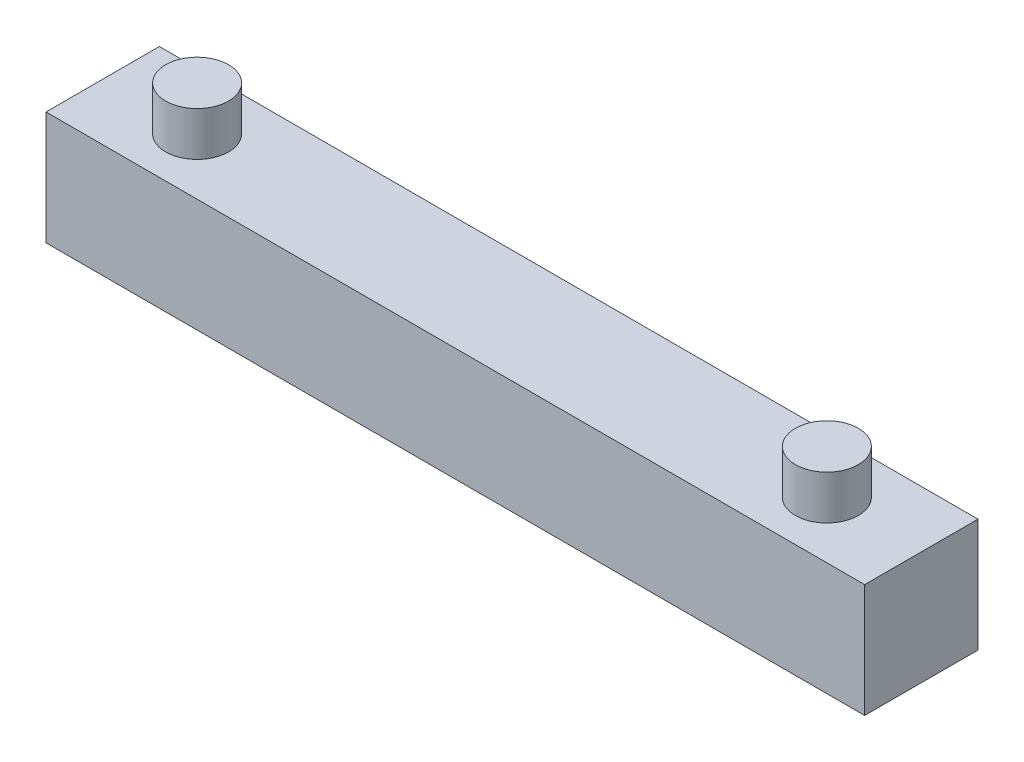
ISO-10303-21;
HEADER;
FILE_DESCRIPTION(('STEP AP214'),'2;1');
FILE_NAME('part.step','',(''),(''),'','','');
FILE_SCHEMA(('AUTOMOTIVE_DESIGN { 1 0 10303 214 1 1 1 1 }'));
ENDSEC;
DATA;
#1=APPLICATION_CONTEXT('core data for automotive mechanical design processes');
#2=APPLICATION_PROTOCOL_DEFINITION('international standard','automotive_design',2000,#1);
#3=PRODUCT_CONTEXT('',#1,'mechanical');
#4=PRODUCT('Part','Part','',(#3));
#5=PRODUCT_RELATED_PRODUCT_CATEGORY('part','',(#4));
#6=PRODUCT_DEFINITION_FORMATION('','',#4);
#7=PRODUCT_DEFINITION_CONTEXT('part definition',#1,'design');
#8=PRODUCT_DEFINITION('design','',#6,#7);
#9=PRODUCT_DEFINITION_SHAPE('','',#8);
#10=(LENGTH_UNIT() NAMED_UNIT(*) SI_UNIT(.MILLI.,.METRE.));
#11=(NAMED_UNIT(*) PLANE_ANGLE_UNIT() SI_UNIT($,.RADIAN.));
#12=(NAMED_UNIT(*) SI_UNIT($,.STERADIAN.) SOLID_ANGLE_UNIT());
#13=UNCERTAINTY_MEASURE_WITH_UNIT(LENGTH_MEASURE(1.E-05),#10,'distance_accuracy_value','');
#14=(GEOMETRIC_REPRESENTATION_CONTEXT(3) GLOBAL_UNCERTAINTY_ASSIGNED_CONTEXT((#13)) GLOBAL_UNIT_ASSIGNED_CONTEXT((#10,
#11,#12)) REPRESENTATION_CONTEXT('',''));
#15=CARTESIAN_POINT('',(0.,0.,0.));
#16=DIRECTION('',(0.,0.,1.));
#17=DIRECTION('',(1.,0.,0.));
#18=AXIS2_PLACEMENT_3D('',#15,#16,#17);
#19=CARTESIAN_POINT('',(0.,9.,-8.99999999999999));
#20=DIRECTION('',(1.,0.,0.));
#21=DIRECTION('',(0.,0.,-1.));
#22=AXIS2_PLACEMENT_3D('',#19,#20,#21);
#23=PLANE('',#22);
#24=DIRECTION('',(0.,0.,1.));
#25=VECTOR('',#24,1.);
#26=CARTESIAN_POINT('',(0.,0.,-8.99999999999999));
#27=LINE('',#26,#25);
#28=CARTESIAN_POINT('',(0.,0.,-8.99999999999999));
#29=VERTEX_POINT('',#28);
#30=CARTESIAN_POINT('',(0.,0.,0.));
#31=VERTEX_POINT('',#30);
#32=EDGE_CURVE('E96',#29,#31,#27,.T.);
#33=ORIENTED_EDGE('',*,*,#32,.T.);
#34=DIRECTION('',(0.,-1.,0.));
#35=VECTOR('',#34,1.);
#36=CARTESIAN_POINT('',(0.,9.,0.));
#37=LINE('',#36,#35);
#38=CARTESIAN_POINT('',(0.,9.,0.));
#39=VERTEX_POINT('',#38);
#40=EDGE_CURVE('E11',#39,#31,#37,.T.);
#41=ORIENTED_EDGE('',*,*,#40,.F.);
#42=DIRECTION('',(0.,0.,1.));
#43=VECTOR('',#42,1.);
#44=CARTESIAN_POINT('',(0.,9.,-8.99999999999999));
#45=LINE('',#44,#43);
#46=CARTESIAN_POINT('',(0.,9.,-8.99999999999999));
#47=VERTEX_POINT('',#46);
#48=EDGE_CURVE('E84',#47,#39,#45,.T.);
#49=ORIENTED_EDGE('',*,*,#48,.F.);
#50=DIRECTION('',(0.,-1.,0.));
#51=VECTOR('',#50,1.);
#52=CARTESIAN_POINT('',(0.,9.,-8.99999999999999));
#53=LINE('',#52,#51);
#54=EDGE_CURVE('E92',#47,#29,#53,.T.);
#55=ORIENTED_EDGE('',*,*,#54,.T.);
#56=EDGE_LOOP('',(#33,#41,#49,#55));
#57=FACE_BOUND('',#56,.T.);
#58=ADVANCED_FACE('F33',(#57),#23,.F.);
#59=CARTESIAN_POINT('',(0.,9.,0.));
#60=DIRECTION('',(0.,0.,-1.));
#61=DIRECTION('',(-1.,0.,0.));
#62=AXIS2_PLACEMENT_3D('',#59,#60,#61);
#63=PLANE('',#62);
#64=DIRECTION('',(1.,0.,0.));
#65=VECTOR('',#64,1.);
#66=CARTESIAN_POINT('',(0.,0.,0.));
#67=LINE('',#66,#65);
#68=CARTESIAN_POINT('',(65.,0.,0.));
#69=VERTEX_POINT('',#68);
#70=EDGE_CURVE('E88',#31,#69,#67,.T.);
#71=ORIENTED_EDGE('',*,*,#70,.T.);
#72=DIRECTION('',(0.,-1.,0.));
#73=VECTOR('',#72,1.);
#74=CARTESIAN_POINT('',(65.,9.,0.));
#75=LINE('',#74,#73);
#76=CARTESIAN_POINT('',(65.,9.,0.));
#77=VERTEX_POINT('',#76);
#78=EDGE_CURVE('E41',#77,#69,#75,.T.);
#79=ORIENTED_EDGE('',*,*,#78,.F.);
#80=DIRECTION('',(1.,0.,0.));
#81=VECTOR('',#80,1.);
#82=CARTESIAN_POINT('',(0.,9.,0.));
#83=LINE('',#82,#81);
#84=EDGE_CURVE('E79',#39,#77,#83,.T.);
#85=ORIENTED_EDGE('',*,*,#84,.F.);
#86=ORIENTED_EDGE('',*,*,#40,.T.);
#87=EDGE_LOOP('',(#71,#79,#85,#86));
#88=FACE_BOUND('',#87,.T.);
#89=ADVANCED_FACE('F87',(#88),#63,.F.);
#90=CARTESIAN_POINT('',(65.,9.,0.));
#91=DIRECTION('',(-1.,0.,0.));
#92=DIRECTION('',(0.,0.,1.));
#93=AXIS2_PLACEMENT_3D('',#90,#91,#92);
#94=PLANE('',#93);
#95=DIRECTION('',(0.,0.,-1.));
#96=VECTOR('',#95,1.);
#97=CARTESIAN_POINT('',(65.,0.,0.));
#98=LINE('',#97,#96);
#99=CARTESIAN_POINT('',(65.,0.,-9.));
#100=VERTEX_POINT('',#99);
#101=EDGE_CURVE('E66',#69,#100,#98,.T.);
#102=ORIENTED_EDGE('',*,*,#101,.T.);
#103=DIRECTION('',(0.,-1.,0.));
#104=VECTOR('',#103,1.);
#105=CARTESIAN_POINT('',(65.,9.,-9.));
#106=LINE('',#105,#104);
#107=CARTESIAN_POINT('',(65.,9.,-9.));
#108=VERTEX_POINT('',#107);
#109=EDGE_CURVE('E89',#108,#100,#106,.T.);
#110=ORIENTED_EDGE('',*,*,#109,.F.);
#111=DIRECTION('',(0.,0.,-1.));
#112=VECTOR('',#111,1.);
#113=CARTESIAN_POINT('',(65.,9.,0.));
#114=LINE('',#113,#112);
#115=EDGE_CURVE('E82',#77,#108,#114,.T.);
#116=ORIENTED_EDGE('',*,*,#115,.F.);
#117=ORIENTED_EDGE('',*,*,#78,.T.);
#118=EDGE_LOOP('',(#102,#110,#116,#117));
#119=FACE_BOUND('',#118,.T.);
#120=ADVANCED_FACE('F90',(#119),#94,.F.);
#121=CARTESIAN_POINT('',(65.,9.,-9.));
#122=DIRECTION('',(0.,0.,1.));
#123=DIRECTION('',(1.,0.,0.));
#124=AXIS2_PLACEMENT_3D('',#121,#122,#123);
#125=PLANE('',#124);
#126=DIRECTION('',(-1.,0.,0.));
#127=VECTOR('',#126,1.);
#128=CARTESIAN_POINT('',(65.,0.,-9.));
#129=LINE('',#128,#127);
#130=EDGE_CURVE('E72',#100,#29,#129,.T.);
#131=ORIENTED_EDGE('',*,*,#130,.T.);
#132=ORIENTED_EDGE('',*,*,#54,.F.);
#133=DIRECTION('',(-1.,0.,0.));
#134=VECTOR('',#133,1.);
#135=CARTESIAN_POINT('',(65.,9.,-9.));
#136=LINE('',#135,#134);
#137=EDGE_CURVE('E49',#108,#47,#136,.T.);
#138=ORIENTED_EDGE('',*,*,#137,.F.);
#139=ORIENTED_EDGE('',*,*,#109,.T.);
#140=EDGE_LOOP('',(#131,#132,#138,#139));
#141=FACE_BOUND('',#140,.T.);
#142=ADVANCED_FACE('F104',(#141),#125,.F.);
#143=CARTESIAN_POINT('',(0.,9.,0.));
#144=DIRECTION('',(0.,1.,0.));
#145=DIRECTION('',(0.,0.,1.));
#146=AXIS2_PLACEMENT_3D('',#143,#144,#145);
#147=PLANE('',#146);
#148=CARTESIAN_POINT('',(57.5,9.,-4.5));
#149=DIRECTION('',(0.,1.,0.));
#150=DIRECTION('',(0.,0.,1.));
#151=AXIS2_PLACEMENT_3D('',#148,#149,#150);
#152=CIRCLE('',#151,2.5);
#153=CARTESIAN_POINT('',(57.5,9.,-2.));
#154=VERTEX_POINT('',#153);
#155=EDGE_CURVE('E116',#154,#154,#152,.T.);
#156=ORIENTED_EDGE('',*,*,#155,.F.);
#157=EDGE_LOOP('',(#156));
#158=FACE_BOUND('',#157,.T.);
#159=CARTESIAN_POINT('',(7.5,9.,-4.5));
#160=DIRECTION('',(0.,1.,0.));
#161=DIRECTION('',(0.,0.,1.));
#162=AXIS2_PLACEMENT_3D('',#159,#160,#161);
#163=CIRCLE('',#162,2.5);
#164=CARTESIAN_POINT('',(7.5,9.,-2.));
#165=VERTEX_POINT('',#164);
#166=EDGE_CURVE('E110',#165,#165,#163,.T.);
#167=ORIENTED_EDGE('',*,*,#166,.F.);
#168=EDGE_LOOP('',(#167));
#169=FACE_BOUND('',#168,.T.);
#170=ORIENTED_EDGE('',*,*,#48,.T.);
#171=ORIENTED_EDGE('',*,*,#84,.T.);
#172=ORIENTED_EDGE('',*,*,#115,.T.);
#173=ORIENTED_EDGE('',*,*,#137,.T.);
#174=EDGE_LOOP('',(#170,#171,#172,#173));
#175=FACE_BOUND('',#174,.T.);
#176=ADVANCED_FACE('F80',(#158,#169,#175),#147,.T.);
#177=CARTESIAN_POINT('',(0.,0.,0.));
#178=DIRECTION('',(0.,1.,0.));
#179=DIRECTION('',(0.,0.,1.));
#180=AXIS2_PLACEMENT_3D('',#177,#178,#179);
#181=PLANE('',#180);
#182=ORIENTED_EDGE('',*,*,#32,.F.);
#183=ORIENTED_EDGE('',*,*,#130,.F.);
#184=ORIENTED_EDGE('',*,*,#101,.F.);
#185=ORIENTED_EDGE('',*,*,#70,.F.);
#186=EDGE_LOOP('',(#182,#183,#184,#185));
#187=FACE_BOUND('',#186,.T.);
#188=ADVANCED_FACE('F107',(#187),#181,.F.);
#189=CARTESIAN_POINT('',(7.5,12.5,-4.5));
#190=DIRECTION('',(0.,-1.,0.));
#191=DIRECTION('',(0.,0.,-1.));
#192=AXIS2_PLACEMENT_3D('',#189,#190,#191);
#193=CYLINDRICAL_SURFACE('',#192,2.5);
#194=CARTESIAN_POINT('',(7.5,12.5,-4.5));
#195=DIRECTION('',(0.,1.,0.));
#196=DIRECTION('',(0.,0.,1.));
#197=AXIS2_PLACEMENT_3D('',#194,#195,#196);
#198=CIRCLE('',#197,2.5);
#199=CARTESIAN_POINT('',(7.5,12.5,-2.));
#200=VERTEX_POINT('',#199);
#201=EDGE_CURVE('E99',#200,#200,#198,.T.);
#202=ORIENTED_EDGE('',*,*,#201,.F.);
#203=EDGE_LOOP('',(#202));
#204=FACE_BOUND('',#203,.T.);
#205=ORIENTED_EDGE('',*,*,#166,.T.);
#206=EDGE_LOOP('',(#205));
#207=FACE_BOUND('',#206,.T.);
#208=ADVANCED_FACE('F136',(#204,#207),#193,.T.);
#209=CARTESIAN_POINT('',(7.5,12.5,-4.5));
#210=DIRECTION('',(0.,1.,0.));
#211=DIRECTION('',(0.,0.,1.));
#212=AXIS2_PLACEMENT_3D('',#209,#210,#211);
#213=PLANE('',#212);
#214=ORIENTED_EDGE('',*,*,#201,.T.);
#215=EDGE_LOOP('',(#214));
#216=FACE_BOUND('',#215,.T.);
#217=ADVANCED_FACE('F127',(#216),#213,.T.);
#218=CARTESIAN_POINT('',(57.5,12.5,-4.5));
#219=DIRECTION('',(0.,-1.,0.));
#220=DIRECTION('',(0.,0.,-1.));
#221=AXIS2_PLACEMENT_3D('',#218,#219,#220);
#222=CYLINDRICAL_SURFACE('',#221,2.5);
#223=CARTESIAN_POINT('',(57.5,12.5,-4.5));
#224=DIRECTION('',(0.,1.,0.));
#225=DIRECTION('',(0.,0.,1.));
#226=AXIS2_PLACEMENT_3D('',#223,#224,#225);
#227=CIRCLE('',#226,2.5);
#228=CARTESIAN_POINT('',(57.5,12.5,-2.));
#229=VERTEX_POINT('',#228);
#230=EDGE_CURVE('E113',#229,#229,#227,.T.);
#231=ORIENTED_EDGE('',*,*,#230,.F.);
#232=EDGE_LOOP('',(#231));
#233=FACE_BOUND('',#232,.T.);
#234=ORIENTED_EDGE('',*,*,#155,.T.);
#235=EDGE_LOOP('',(#234));
#236=FACE_BOUND('',#235,.T.);
#237=ADVANCED_FACE('F124',(#233,#236),#222,.T.);
#238=CARTESIAN_POINT('',(57.5,12.5,-4.5));
#239=DIRECTION('',(0.,1.,0.));
#240=DIRECTION('',(0.,0.,1.));
#241=AXIS2_PLACEMENT_3D('',#238,#239,#240);
#242=PLANE('',#241);
#243=ORIENTED_EDGE('',*,*,#230,.T.);
#244=EDGE_LOOP('',(#243));
#245=FACE_BOUND('',#244,.T.);
#246=ADVANCED_FACE('F122',(#245),#242,.T.);
#247=CLOSED_SHELL('',(#58,#89,#120,#142,#176,#188,#208,#217,#237,#246));
#248=MANIFOLD_SOLID_BREP('B2',#247);
#249=ADVANCED_BREP_SHAPE_REPRESENTATION('',(#18,#248),#14);
#250=SHAPE_DEFINITION_REPRESENTATION(#9,#249);
ENDSEC;
END-ISO-10303-21;
